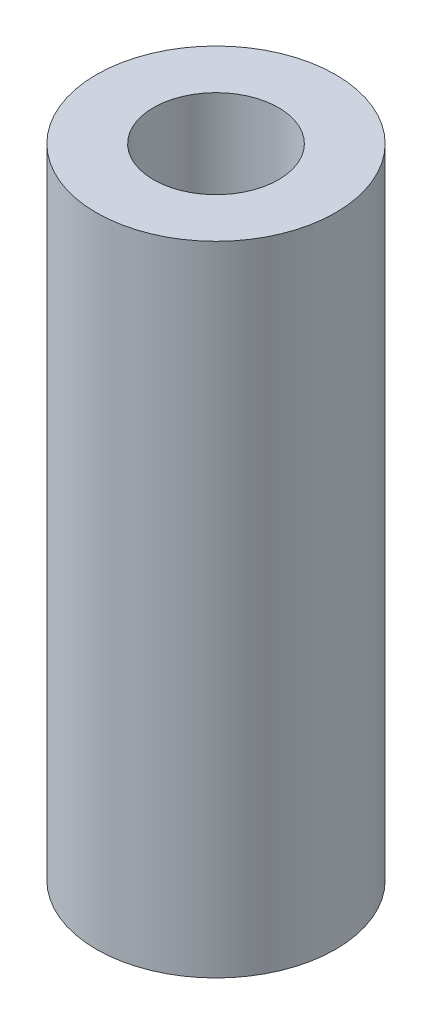
ISO-10303-21;
HEADER;
FILE_DESCRIPTION(('STEP AP214'),'2;1');
FILE_NAME('part.step','',(''),(''),'','','');
FILE_SCHEMA(('AUTOMOTIVE_DESIGN { 1 0 10303 214 1 1 1 1 }'));
ENDSEC;
DATA;
#1=APPLICATION_CONTEXT('core data for automotive mechanical design processes');
#2=APPLICATION_PROTOCOL_DEFINITION('international standard','automotive_design',2000,#1);
#3=PRODUCT_CONTEXT('',#1,'mechanical');
#4=PRODUCT('Part','Part','',(#3));
#5=PRODUCT_RELATED_PRODUCT_CATEGORY('part','',(#4));
#6=PRODUCT_DEFINITION_FORMATION('','',#4);
#7=PRODUCT_DEFINITION_CONTEXT('part definition',#1,'design');
#8=PRODUCT_DEFINITION('design','',#6,#7);
#9=PRODUCT_DEFINITION_SHAPE('','',#8);
#10=(LENGTH_UNIT() NAMED_UNIT(*) SI_UNIT(.MILLI.,.METRE.));
#11=(NAMED_UNIT(*) PLANE_ANGLE_UNIT() SI_UNIT($,.RADIAN.));
#12=(NAMED_UNIT(*) SI_UNIT($,.STERADIAN.) SOLID_ANGLE_UNIT());
#13=UNCERTAINTY_MEASURE_WITH_UNIT(LENGTH_MEASURE(1.E-05),#10,'distance_accuracy_value','');
#14=(GEOMETRIC_REPRESENTATION_CONTEXT(3) GLOBAL_UNCERTAINTY_ASSIGNED_CONTEXT((#13)) GLOBAL_UNIT_ASSIGNED_CONTEXT((#10,
#11,#12)) REPRESENTATION_CONTEXT('',''));
#15=CARTESIAN_POINT('',(0.,0.,0.));
#16=DIRECTION('',(0.,0.,1.));
#17=DIRECTION('',(1.,0.,0.));
#18=AXIS2_PLACEMENT_3D('',#15,#16,#17);
#19=CARTESIAN_POINT('',(0.,12.7,0.));
#20=DIRECTION('',(0.,1.,0.));
#21=DIRECTION('',(0.,0.,1.));
#22=AXIS2_PLACEMENT_3D('',#19,#20,#21);
#23=PLANE('',#22);
#24=CARTESIAN_POINT('',(0.,12.7,0.));
#25=DIRECTION('',(0.,1.,0.));
#26=DIRECTION('',(0.,0.,1.));
#27=AXIS2_PLACEMENT_3D('',#24,#25,#26);
#28=CIRCLE('',#27,4.7625);
#29=CARTESIAN_POINT('',(0.,12.7,4.7625));
#30=VERTEX_POINT('',#29);
#31=EDGE_CURVE('E10',#30,#30,#28,.T.);
#32=ORIENTED_EDGE('',*,*,#31,.T.);
#33=EDGE_LOOP('',(#32));
#34=FACE_BOUND('',#33,.T.);
#35=CARTESIAN_POINT('',(0.,12.7,0.));
#36=DIRECTION('',(0.,1.,0.));
#37=DIRECTION('',(0.,0.,1.));
#38=AXIS2_PLACEMENT_3D('',#35,#36,#37);
#39=CIRCLE('',#38,2.4892);
#40=CARTESIAN_POINT('',(0.,12.7,2.4892));
#41=VERTEX_POINT('',#40);
#42=EDGE_CURVE('E43',#41,#41,#39,.T.);
#43=ORIENTED_EDGE('',*,*,#42,.F.);
#44=EDGE_LOOP('',(#43));
#45=FACE_BOUND('',#44,.T.);
#46=ADVANCED_FACE('F32',(#34,#45),#23,.T.);
#47=CARTESIAN_POINT('',(0.,-12.7,0.));
#48=DIRECTION('',(0.,1.,0.));
#49=DIRECTION('',(0.,0.,1.));
#50=AXIS2_PLACEMENT_3D('',#47,#48,#49);
#51=PLANE('',#50);
#52=CARTESIAN_POINT('',(0.,-12.7,0.));
#53=DIRECTION('',(0.,1.,0.));
#54=DIRECTION('',(0.,0.,1.));
#55=AXIS2_PLACEMENT_3D('',#52,#53,#54);
#56=CIRCLE('',#55,4.7625);
#57=CARTESIAN_POINT('',(0.,-12.7,4.7625));
#58=VERTEX_POINT('',#57);
#59=EDGE_CURVE('E36',#58,#58,#56,.T.);
#60=ORIENTED_EDGE('',*,*,#59,.F.);
#61=EDGE_LOOP('',(#60));
#62=FACE_BOUND('',#61,.T.);
#63=CARTESIAN_POINT('',(0.,-12.7,0.));
#64=DIRECTION('',(0.,1.,0.));
#65=DIRECTION('',(0.,0.,1.));
#66=AXIS2_PLACEMENT_3D('',#63,#64,#65);
#67=CIRCLE('',#66,2.4892);
#68=CARTESIAN_POINT('',(0.,-12.7,2.4892));
#69=VERTEX_POINT('',#68);
#70=EDGE_CURVE('E45',#69,#69,#67,.T.);
#71=ORIENTED_EDGE('',*,*,#70,.T.);
#72=EDGE_LOOP('',(#71));
#73=FACE_BOUND('',#72,.T.);
#74=ADVANCED_FACE('F55',(#62,#73),#51,.F.);
#75=CARTESIAN_POINT('',(0.,12.7,0.));
#76=DIRECTION('',(0.,-1.,0.));
#77=DIRECTION('',(0.,0.,-1.));
#78=AXIS2_PLACEMENT_3D('',#75,#76,#77);
#79=CYLINDRICAL_SURFACE('',#78,4.7625);
#80=ORIENTED_EDGE('',*,*,#31,.F.);
#81=EDGE_LOOP('',(#80));
#82=FACE_BOUND('',#81,.T.);
#83=ORIENTED_EDGE('',*,*,#59,.T.);
#84=EDGE_LOOP('',(#83));
#85=FACE_BOUND('',#84,.T.);
#86=ADVANCED_FACE('F34',(#82,#85),#79,.T.);
#87=CARTESIAN_POINT('',(0.,12.7,0.));
#88=DIRECTION('',(0.,-1.,0.));
#89=DIRECTION('',(0.,0.,-1.));
#90=AXIS2_PLACEMENT_3D('',#87,#88,#89);
#91=CYLINDRICAL_SURFACE('',#90,2.4892);
#92=ORIENTED_EDGE('',*,*,#42,.T.);
#93=EDGE_LOOP('',(#92));
#94=FACE_BOUND('',#93,.T.);
#95=ORIENTED_EDGE('',*,*,#70,.F.);
#96=EDGE_LOOP('',(#95));
#97=FACE_BOUND('',#96,.T.);
#98=ADVANCED_FACE('F51',(#94,#97),#91,.F.);
#99=CLOSED_SHELL('',(#46,#74,#86,#98));
#100=MANIFOLD_SOLID_BREP('B2',#99);
#101=ADVANCED_BREP_SHAPE_REPRESENTATION('',(#18,#100),#14);
#102=SHAPE_DEFINITION_REPRESENTATION(#9,#101);
ENDSEC;
END-ISO-10303-21;
